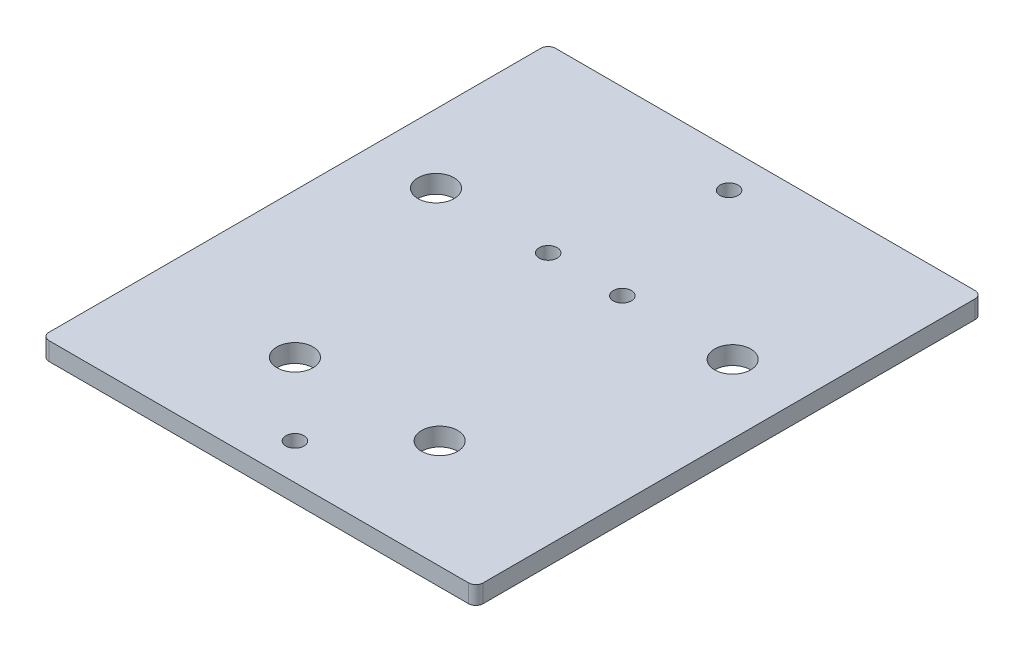
ISO-10303-21;
HEADER;
FILE_DESCRIPTION(('STEP AP214'),'2;1');
FILE_NAME('part.step','',(''),(''),'','','');
FILE_SCHEMA(('AUTOMOTIVE_DESIGN { 1 0 10303 214 1 1 1 1 }'));
ENDSEC;
DATA;
#1=APPLICATION_CONTEXT('core data for automotive mechanical design processes');
#2=APPLICATION_PROTOCOL_DEFINITION('international standard','automotive_design',2000,#1);
#3=PRODUCT_CONTEXT('',#1,'mechanical');
#4=PRODUCT('Part','Part','',(#3));
#5=PRODUCT_RELATED_PRODUCT_CATEGORY('part','',(#4));
#6=PRODUCT_DEFINITION_FORMATION('','',#4);
#7=PRODUCT_DEFINITION_CONTEXT('part definition',#1,'design');
#8=PRODUCT_DEFINITION('design','',#6,#7);
#9=PRODUCT_DEFINITION_SHAPE('','',#8);
#10=(LENGTH_UNIT() NAMED_UNIT(*) SI_UNIT(.MILLI.,.METRE.));
#11=(NAMED_UNIT(*) PLANE_ANGLE_UNIT() SI_UNIT($,.RADIAN.));
#12=(NAMED_UNIT(*) SI_UNIT($,.STERADIAN.) SOLID_ANGLE_UNIT());
#13=UNCERTAINTY_MEASURE_WITH_UNIT(LENGTH_MEASURE(1.E-05),#10,'distance_accuracy_value','');
#14=(GEOMETRIC_REPRESENTATION_CONTEXT(3) GLOBAL_UNCERTAINTY_ASSIGNED_CONTEXT((#13)) GLOBAL_UNIT_ASSIGNED_CONTEXT((#10,
#11,#12)) REPRESENTATION_CONTEXT('',''));
#15=CARTESIAN_POINT('',(0.,0.,0.));
#16=DIRECTION('',(0.,0.,1.));
#17=DIRECTION('',(1.,0.,0.));
#18=AXIS2_PLACEMENT_3D('',#15,#16,#17);
#19=CARTESIAN_POINT('',(0.,6.35,0.));
#20=DIRECTION('',(0.,-1.,0.));
#21=DIRECTION('',(0.,0.,-1.));
#22=AXIS2_PLACEMENT_3D('',#19,#20,#21);
#23=PLANE('',#22);
#24=DIRECTION('',(-1.,0.,0.));
#25=VECTOR('',#24,1.);
#26=CARTESIAN_POINT('',(0.,6.35,-177.8));
#27=LINE('',#26,#25);
#28=CARTESIAN_POINT('',(149.86,6.35,-177.8));
#29=VERTEX_POINT('',#28);
#30=CARTESIAN_POINT('',(2.54,6.35,-177.8));
#31=VERTEX_POINT('',#30);
#32=EDGE_CURVE('E140',#29,#31,#27,.T.);
#33=ORIENTED_EDGE('',*,*,#32,.T.);
#34=CARTESIAN_POINT('',(2.54,6.35,-175.26));
#35=DIRECTION('',(0.,-1.,0.));
#36=DIRECTION('',(0.,0.,-1.));
#37=AXIS2_PLACEMENT_3D('',#34,#35,#36);
#38=CIRCLE('',#37,2.54);
#39=CARTESIAN_POINT('',(0.,6.35,-175.26));
#40=VERTEX_POINT('',#39);
#41=EDGE_CURVE('E159',#31,#40,#38,.F.);
#42=ORIENTED_EDGE('',*,*,#41,.T.);
#43=DIRECTION('',(0.,0.,1.));
#44=VECTOR('',#43,1.);
#45=CARTESIAN_POINT('',(0.,6.35,0.));
#46=LINE('',#45,#44);
#47=CARTESIAN_POINT('',(0.,6.35,-2.54));
#48=VERTEX_POINT('',#47);
#49=EDGE_CURVE('E123',#40,#48,#46,.T.);
#50=ORIENTED_EDGE('',*,*,#49,.T.);
#51=CARTESIAN_POINT('',(2.54,6.35,-2.54));
#52=DIRECTION('',(0.,-1.,0.));
#53=DIRECTION('',(0.,0.,-1.));
#54=AXIS2_PLACEMENT_3D('',#51,#52,#53);
#55=CIRCLE('',#54,2.54);
#56=CARTESIAN_POINT('',(2.54,6.35,0.));
#57=VERTEX_POINT('',#56);
#58=EDGE_CURVE('E154',#48,#57,#55,.F.);
#59=ORIENTED_EDGE('',*,*,#58,.T.);
#60=DIRECTION('',(1.,0.,0.));
#61=VECTOR('',#60,1.);
#62=CARTESIAN_POINT('',(0.,6.35,0.));
#63=LINE('',#62,#61);
#64=CARTESIAN_POINT('',(149.86,6.35,0.));
#65=VERTEX_POINT('',#64);
#66=EDGE_CURVE('E170',#57,#65,#63,.T.);
#67=ORIENTED_EDGE('',*,*,#66,.T.);
#68=CARTESIAN_POINT('',(149.86,6.35,-2.54000000000002));
#69=DIRECTION('',(0.,-1.,0.));
#70=DIRECTION('',(0.,0.,-1.));
#71=AXIS2_PLACEMENT_3D('',#68,#69,#70);
#72=CIRCLE('',#71,2.54);
#73=CARTESIAN_POINT('',(152.4,6.35,-2.54000000000002));
#74=VERTEX_POINT('',#73);
#75=EDGE_CURVE('E59',#65,#74,#72,.F.);
#76=ORIENTED_EDGE('',*,*,#75,.T.);
#77=DIRECTION('',(0.,0.,-1.));
#78=VECTOR('',#77,1.);
#79=CARTESIAN_POINT('',(152.4,6.35,0.));
#80=LINE('',#79,#78);
#81=CARTESIAN_POINT('',(152.4,6.35,-175.26));
#82=VERTEX_POINT('',#81);
#83=EDGE_CURVE('E178',#74,#82,#80,.T.);
#84=ORIENTED_EDGE('',*,*,#83,.T.);
#85=CARTESIAN_POINT('',(149.86,6.35,-175.26));
#86=DIRECTION('',(0.,-1.,0.));
#87=DIRECTION('',(0.,0.,-1.));
#88=AXIS2_PLACEMENT_3D('',#85,#86,#87);
#89=CIRCLE('',#88,2.54);
#90=EDGE_CURVE('E157',#82,#29,#89,.F.);
#91=ORIENTED_EDGE('',*,*,#90,.T.);
#92=EDGE_LOOP('',(#33,#42,#50,#59,#67,#76,#84,#91));
#93=FACE_BOUND('',#92,.T.);
#94=CARTESIAN_POINT('',(24.13,6.35,-114.3));
#95=DIRECTION('',(0.,1.,0.));
#96=DIRECTION('',(0.,0.,1.));
#97=AXIS2_PLACEMENT_3D('',#94,#95,#96);
#98=CIRCLE('',#97,6.35000000000002);
#99=CARTESIAN_POINT('',(24.13,6.35,-107.95));
#100=VERTEX_POINT('',#99);
#101=EDGE_CURVE('E131',#100,#100,#98,.T.);
#102=ORIENTED_EDGE('',*,*,#101,.F.);
#103=EDGE_LOOP('',(#102));
#104=FACE_BOUND('',#103,.T.);
#105=CARTESIAN_POINT('',(128.27,6.35,-114.3));
#106=DIRECTION('',(0.,1.,0.));
#107=DIRECTION('',(0.,0.,1.));
#108=AXIS2_PLACEMENT_3D('',#105,#106,#107);
#109=CIRCLE('',#108,6.34999999999999);
#110=CARTESIAN_POINT('',(128.27,6.35,-107.95));
#111=VERTEX_POINT('',#110);
#112=EDGE_CURVE('E185',#111,#111,#109,.T.);
#113=ORIENTED_EDGE('',*,*,#112,.F.);
#114=EDGE_LOOP('',(#113));
#115=FACE_BOUND('',#114,.T.);
#116=CARTESIAN_POINT('',(50.8,6.35,-38.1));
#117=DIRECTION('',(0.,1.,0.));
#118=DIRECTION('',(0.,0.,1.));
#119=AXIS2_PLACEMENT_3D('',#116,#117,#118);
#120=CIRCLE('',#119,6.35000000000001);
#121=CARTESIAN_POINT('',(50.8,6.35,-31.75));
#122=VERTEX_POINT('',#121);
#123=EDGE_CURVE('E190',#122,#122,#120,.T.);
#124=ORIENTED_EDGE('',*,*,#123,.F.);
#125=EDGE_LOOP('',(#124));
#126=FACE_BOUND('',#125,.T.);
#127=CARTESIAN_POINT('',(101.6,6.35,-38.1));
#128=DIRECTION('',(0.,1.,0.));
#129=DIRECTION('',(0.,0.,1.));
#130=AXIS2_PLACEMENT_3D('',#127,#128,#129);
#131=CIRCLE('',#130,6.35);
#132=CARTESIAN_POINT('',(101.6,6.35,-31.75));
#133=VERTEX_POINT('',#132);
#134=EDGE_CURVE('E196',#133,#133,#131,.T.);
#135=ORIENTED_EDGE('',*,*,#134,.F.);
#136=EDGE_LOOP('',(#135));
#137=FACE_BOUND('',#136,.T.);
#138=CARTESIAN_POINT('',(76.2,6.35,-165.1));
#139=DIRECTION('',(0.,1.,0.));
#140=DIRECTION('',(0.,0.,1.));
#141=AXIS2_PLACEMENT_3D('',#138,#139,#140);
#142=CIRCLE('',#141,3.175);
#143=CARTESIAN_POINT('',(76.2,6.35,-161.925));
#144=VERTEX_POINT('',#143);
#145=EDGE_CURVE('E202',#144,#144,#142,.T.);
#146=ORIENTED_EDGE('',*,*,#145,.F.);
#147=EDGE_LOOP('',(#146));
#148=FACE_BOUND('',#147,.T.);
#149=CARTESIAN_POINT('',(76.2,6.35,-12.7));
#150=DIRECTION('',(0.,1.,0.));
#151=DIRECTION('',(0.,0.,1.));
#152=AXIS2_PLACEMENT_3D('',#149,#150,#151);
#153=CIRCLE('',#152,3.175);
#154=CARTESIAN_POINT('',(76.2,6.35,-9.525));
#155=VERTEX_POINT('',#154);
#156=EDGE_CURVE('E208',#155,#155,#153,.T.);
#157=ORIENTED_EDGE('',*,*,#156,.F.);
#158=EDGE_LOOP('',(#157));
#159=FACE_BOUND('',#158,.T.);
#160=CARTESIAN_POINT('',(63.5,6.35,-114.3));
#161=DIRECTION('',(0.,1.,0.));
#162=DIRECTION('',(0.,0.,1.));
#163=AXIS2_PLACEMENT_3D('',#160,#161,#162);
#164=CIRCLE('',#163,3.175);
#165=CARTESIAN_POINT('',(63.5,6.35,-111.125));
#166=VERTEX_POINT('',#165);
#167=EDGE_CURVE('E214',#166,#166,#164,.T.);
#168=ORIENTED_EDGE('',*,*,#167,.F.);
#169=EDGE_LOOP('',(#168));
#170=FACE_BOUND('',#169,.T.);
#171=CARTESIAN_POINT('',(89.535,6.35,-114.3));
#172=DIRECTION('',(0.,1.,0.));
#173=DIRECTION('',(0.,0.,1.));
#174=AXIS2_PLACEMENT_3D('',#171,#172,#173);
#175=CIRCLE('',#174,3.175);
#176=CARTESIAN_POINT('',(89.535,6.35,-111.125));
#177=VERTEX_POINT('',#176);
#178=EDGE_CURVE('E220',#177,#177,#175,.T.);
#179=ORIENTED_EDGE('',*,*,#178,.F.);
#180=EDGE_LOOP('',(#179));
#181=FACE_BOUND('',#180,.T.);
#182=ADVANCED_FACE('F37',(#93,#104,#115,#126,#137,#148,#159,#170,#181),#23,.F.);
#183=CARTESIAN_POINT('',(0.,0.,0.));
#184=DIRECTION('',(0.,-1.,0.));
#185=DIRECTION('',(0.,0.,-1.));
#186=AXIS2_PLACEMENT_3D('',#183,#184,#185);
#187=PLANE('',#186);
#188=CARTESIAN_POINT('',(63.5,0.,-114.3));
#189=DIRECTION('',(0.,1.,0.));
#190=DIRECTION('',(0.,0.,1.));
#191=AXIS2_PLACEMENT_3D('',#188,#189,#190);
#192=CIRCLE('',#191,3.175);
#193=CARTESIAN_POINT('',(63.5,0.,-111.125));
#194=VERTEX_POINT('',#193);
#195=EDGE_CURVE('E217',#194,#194,#192,.T.);
#196=ORIENTED_EDGE('',*,*,#195,.T.);
#197=EDGE_LOOP('',(#196));
#198=FACE_BOUND('',#197,.T.);
#199=CARTESIAN_POINT('',(76.2,0.,-165.1));
#200=DIRECTION('',(0.,1.,0.));
#201=DIRECTION('',(0.,0.,1.));
#202=AXIS2_PLACEMENT_3D('',#199,#200,#201);
#203=CIRCLE('',#202,3.175);
#204=CARTESIAN_POINT('',(76.2,0.,-161.925));
#205=VERTEX_POINT('',#204);
#206=EDGE_CURVE('E205',#205,#205,#203,.T.);
#207=ORIENTED_EDGE('',*,*,#206,.T.);
#208=EDGE_LOOP('',(#207));
#209=FACE_BOUND('',#208,.T.);
#210=CARTESIAN_POINT('',(50.8,0.,-38.1));
#211=DIRECTION('',(0.,1.,0.));
#212=DIRECTION('',(0.,0.,1.));
#213=AXIS2_PLACEMENT_3D('',#210,#211,#212);
#214=CIRCLE('',#213,6.35000000000001);
#215=CARTESIAN_POINT('',(50.8,0.,-31.75));
#216=VERTEX_POINT('',#215);
#217=EDGE_CURVE('E193',#216,#216,#214,.T.);
#218=ORIENTED_EDGE('',*,*,#217,.T.);
#219=EDGE_LOOP('',(#218));
#220=FACE_BOUND('',#219,.T.);
#221=CARTESIAN_POINT('',(24.13,0.,-114.3));
#222=DIRECTION('',(0.,1.,0.));
#223=DIRECTION('',(0.,0.,1.));
#224=AXIS2_PLACEMENT_3D('',#221,#222,#223);
#225=CIRCLE('',#224,6.35000000000002);
#226=CARTESIAN_POINT('',(24.13,0.,-107.95));
#227=VERTEX_POINT('',#226);
#228=EDGE_CURVE('E137',#227,#227,#225,.T.);
#229=ORIENTED_EDGE('',*,*,#228,.T.);
#230=EDGE_LOOP('',(#229));
#231=FACE_BOUND('',#230,.T.);
#232=DIRECTION('',(0.,0.,1.));
#233=VECTOR('',#232,1.);
#234=CARTESIAN_POINT('',(0.,0.,0.));
#235=LINE('',#234,#233);
#236=CARTESIAN_POINT('',(0.,0.,-175.26));
#237=VERTEX_POINT('',#236);
#238=CARTESIAN_POINT('',(0.,0.,-2.54));
#239=VERTEX_POINT('',#238);
#240=EDGE_CURVE('E120',#237,#239,#235,.T.);
#241=ORIENTED_EDGE('',*,*,#240,.F.);
#242=CARTESIAN_POINT('',(2.54,0.,-175.26));
#243=DIRECTION('',(0.,-1.,0.));
#244=DIRECTION('',(0.,0.,-1.));
#245=AXIS2_PLACEMENT_3D('',#242,#243,#244);
#246=CIRCLE('',#245,2.54);
#247=CARTESIAN_POINT('',(2.54,0.,-177.8));
#248=VERTEX_POINT('',#247);
#249=EDGE_CURVE('E103',#237,#248,#246,.T.);
#250=ORIENTED_EDGE('',*,*,#249,.T.);
#251=DIRECTION('',(-1.,0.,0.));
#252=VECTOR('',#251,1.);
#253=CARTESIAN_POINT('',(0.,0.,-177.8));
#254=LINE('',#253,#252);
#255=CARTESIAN_POINT('',(149.86,0.,-177.8));
#256=VERTEX_POINT('',#255);
#257=EDGE_CURVE('E144',#256,#248,#254,.T.);
#258=ORIENTED_EDGE('',*,*,#257,.F.);
#259=CARTESIAN_POINT('',(149.86,0.,-175.26));
#260=DIRECTION('',(0.,-1.,0.));
#261=DIRECTION('',(0.,0.,-1.));
#262=AXIS2_PLACEMENT_3D('',#259,#260,#261);
#263=CIRCLE('',#262,2.54);
#264=CARTESIAN_POINT('',(152.4,0.,-175.26));
#265=VERTEX_POINT('',#264);
#266=EDGE_CURVE('E114',#256,#265,#263,.T.);
#267=ORIENTED_EDGE('',*,*,#266,.T.);
#268=DIRECTION('',(0.,0.,-1.));
#269=VECTOR('',#268,1.);
#270=CARTESIAN_POINT('',(152.4,0.,0.));
#271=LINE('',#270,#269);
#272=CARTESIAN_POINT('',(152.4,0.,-2.54000000000002));
#273=VERTEX_POINT('',#272);
#274=EDGE_CURVE('E134',#273,#265,#271,.T.);
#275=ORIENTED_EDGE('',*,*,#274,.F.);
#276=CARTESIAN_POINT('',(149.86,0.,-2.54000000000002));
#277=DIRECTION('',(0.,-1.,0.));
#278=DIRECTION('',(0.,0.,-1.));
#279=AXIS2_PLACEMENT_3D('',#276,#277,#278);
#280=CIRCLE('',#279,2.54);
#281=CARTESIAN_POINT('',(149.86,0.,0.));
#282=VERTEX_POINT('',#281);
#283=EDGE_CURVE('E148',#273,#282,#280,.T.);
#284=ORIENTED_EDGE('',*,*,#283,.T.);
#285=DIRECTION('',(1.,0.,0.));
#286=VECTOR('',#285,1.);
#287=CARTESIAN_POINT('',(0.,0.,0.));
#288=LINE('',#287,#286);
#289=CARTESIAN_POINT('',(2.54,0.,0.));
#290=VERTEX_POINT('',#289);
#291=EDGE_CURVE('E130',#290,#282,#288,.T.);
#292=ORIENTED_EDGE('',*,*,#291,.F.);
#293=CARTESIAN_POINT('',(2.54,0.,-2.54));
#294=DIRECTION('',(0.,-1.,0.));
#295=DIRECTION('',(0.,0.,-1.));
#296=AXIS2_PLACEMENT_3D('',#293,#294,#295);
#297=CIRCLE('',#296,2.54);
#298=EDGE_CURVE('E124',#290,#239,#297,.T.);
#299=ORIENTED_EDGE('',*,*,#298,.T.);
#300=EDGE_LOOP('',(#241,#250,#258,#267,#275,#284,#292,#299));
#301=FACE_BOUND('',#300,.T.);
#302=CARTESIAN_POINT('',(128.27,0.,-114.3));
#303=DIRECTION('',(0.,1.,0.));
#304=DIRECTION('',(0.,0.,1.));
#305=AXIS2_PLACEMENT_3D('',#302,#303,#304);
#306=CIRCLE('',#305,6.34999999999999);
#307=CARTESIAN_POINT('',(128.27,0.,-107.95));
#308=VERTEX_POINT('',#307);
#309=EDGE_CURVE('E187',#308,#308,#306,.T.);
#310=ORIENTED_EDGE('',*,*,#309,.T.);
#311=EDGE_LOOP('',(#310));
#312=FACE_BOUND('',#311,.T.);
#313=CARTESIAN_POINT('',(101.6,0.,-38.1));
#314=DIRECTION('',(0.,1.,0.));
#315=DIRECTION('',(0.,0.,1.));
#316=AXIS2_PLACEMENT_3D('',#313,#314,#315);
#317=CIRCLE('',#316,6.35);
#318=CARTESIAN_POINT('',(101.6,0.,-31.75));
#319=VERTEX_POINT('',#318);
#320=EDGE_CURVE('E199',#319,#319,#317,.T.);
#321=ORIENTED_EDGE('',*,*,#320,.T.);
#322=EDGE_LOOP('',(#321));
#323=FACE_BOUND('',#322,.T.);
#324=CARTESIAN_POINT('',(76.2,0.,-12.7));
#325=DIRECTION('',(0.,1.,0.));
#326=DIRECTION('',(0.,0.,1.));
#327=AXIS2_PLACEMENT_3D('',#324,#325,#326);
#328=CIRCLE('',#327,3.175);
#329=CARTESIAN_POINT('',(76.2,0.,-9.525));
#330=VERTEX_POINT('',#329);
#331=EDGE_CURVE('E211',#330,#330,#328,.T.);
#332=ORIENTED_EDGE('',*,*,#331,.T.);
#333=EDGE_LOOP('',(#332));
#334=FACE_BOUND('',#333,.T.);
#335=CARTESIAN_POINT('',(89.535,0.,-114.3));
#336=DIRECTION('',(0.,1.,0.));
#337=DIRECTION('',(0.,0.,1.));
#338=AXIS2_PLACEMENT_3D('',#335,#336,#337);
#339=CIRCLE('',#338,3.175);
#340=CARTESIAN_POINT('',(89.535,0.,-111.125));
#341=VERTEX_POINT('',#340);
#342=EDGE_CURVE('E223',#341,#341,#339,.T.);
#343=ORIENTED_EDGE('',*,*,#342,.T.);
#344=EDGE_LOOP('',(#343));
#345=FACE_BOUND('',#344,.T.);
#346=ADVANCED_FACE('F127',(#198,#209,#220,#231,#301,#312,#323,#334,#345),#187,.T.);
#347=CARTESIAN_POINT('',(0.,6.35,0.));
#348=DIRECTION('',(1.,0.,0.));
#349=DIRECTION('',(0.,0.,-1.));
#350=AXIS2_PLACEMENT_3D('',#347,#348,#349);
#351=PLANE('',#350);
#352=ORIENTED_EDGE('',*,*,#49,.F.);
#353=DIRECTION('',(0.,-1.,0.));
#354=VECTOR('',#353,1.);
#355=CARTESIAN_POINT('',(0.,6.35,-175.26));
#356=LINE('',#355,#354);
#357=EDGE_CURVE('E107',#40,#237,#356,.T.);
#358=ORIENTED_EDGE('',*,*,#357,.T.);
#359=ORIENTED_EDGE('',*,*,#240,.T.);
#360=DIRECTION('',(0.,-1.,0.));
#361=VECTOR('',#360,1.);
#362=CARTESIAN_POINT('',(0.,6.35,-2.54));
#363=LINE('',#362,#361);
#364=EDGE_CURVE('E125',#239,#48,#363,.F.);
#365=ORIENTED_EDGE('',*,*,#364,.T.);
#366=EDGE_LOOP('',(#352,#358,#359,#365));
#367=FACE_BOUND('',#366,.T.);
#368=ADVANCED_FACE('F119',(#367),#351,.F.);
#369=CARTESIAN_POINT('',(0.,6.35,0.));
#370=DIRECTION('',(0.,0.,-1.));
#371=DIRECTION('',(-1.,0.,0.));
#372=AXIS2_PLACEMENT_3D('',#369,#370,#371);
#373=PLANE('',#372);
#374=ORIENTED_EDGE('',*,*,#291,.T.);
#375=DIRECTION('',(0.,-1.,0.));
#376=VECTOR('',#375,1.);
#377=CARTESIAN_POINT('',(149.86,6.35,0.));
#378=LINE('',#377,#376);
#379=EDGE_CURVE('E11',#282,#65,#378,.F.);
#380=ORIENTED_EDGE('',*,*,#379,.T.);
#381=ORIENTED_EDGE('',*,*,#66,.F.);
#382=DIRECTION('',(0.,-1.,0.));
#383=VECTOR('',#382,1.);
#384=CARTESIAN_POINT('',(2.54,6.35,0.));
#385=LINE('',#384,#383);
#386=EDGE_CURVE('E45',#57,#290,#385,.T.);
#387=ORIENTED_EDGE('',*,*,#386,.T.);
#388=EDGE_LOOP('',(#374,#380,#381,#387));
#389=FACE_BOUND('',#388,.T.);
#390=ADVANCED_FACE('F168',(#389),#373,.F.);
#391=CARTESIAN_POINT('',(152.4,6.35,0.));
#392=DIRECTION('',(-1.,0.,0.));
#393=DIRECTION('',(0.,0.,1.));
#394=AXIS2_PLACEMENT_3D('',#391,#392,#393);
#395=PLANE('',#394);
#396=ORIENTED_EDGE('',*,*,#274,.T.);
#397=DIRECTION('',(0.,-1.,0.));
#398=VECTOR('',#397,1.);
#399=CARTESIAN_POINT('',(152.4,6.35,-175.26));
#400=LINE('',#399,#398);
#401=EDGE_CURVE('E52',#265,#82,#400,.F.);
#402=ORIENTED_EDGE('',*,*,#401,.T.);
#403=ORIENTED_EDGE('',*,*,#83,.F.);
#404=DIRECTION('',(0.,-1.,0.));
#405=VECTOR('',#404,1.);
#406=CARTESIAN_POINT('',(152.4,6.35,-2.54000000000002));
#407=LINE('',#406,#405);
#408=EDGE_CURVE('E161',#74,#273,#407,.T.);
#409=ORIENTED_EDGE('',*,*,#408,.T.);
#410=EDGE_LOOP('',(#396,#402,#403,#409));
#411=FACE_BOUND('',#410,.T.);
#412=ADVANCED_FACE('F177',(#411),#395,.F.);
#413=CARTESIAN_POINT('',(0.,6.35,-177.8));
#414=DIRECTION('',(0.,0.,1.));
#415=DIRECTION('',(1.,0.,0.));
#416=AXIS2_PLACEMENT_3D('',#413,#414,#415);
#417=PLANE('',#416);
#418=ORIENTED_EDGE('',*,*,#257,.T.);
#419=DIRECTION('',(0.,-1.,0.));
#420=VECTOR('',#419,1.);
#421=CARTESIAN_POINT('',(2.54,6.35,-177.8));
#422=LINE('',#421,#420);
#423=EDGE_CURVE('E108',#248,#31,#422,.F.);
#424=ORIENTED_EDGE('',*,*,#423,.T.);
#425=ORIENTED_EDGE('',*,*,#32,.F.);
#426=DIRECTION('',(0.,-1.,0.));
#427=VECTOR('',#426,1.);
#428=CARTESIAN_POINT('',(149.86,6.35,-177.8));
#429=LINE('',#428,#427);
#430=EDGE_CURVE('E113',#29,#256,#429,.T.);
#431=ORIENTED_EDGE('',*,*,#430,.T.);
#432=EDGE_LOOP('',(#418,#424,#425,#431));
#433=FACE_BOUND('',#432,.T.);
#434=ADVANCED_FACE('F244',(#433),#417,.F.);
#435=CARTESIAN_POINT('',(24.13,6.35,-114.3));
#436=DIRECTION('',(0.,-1.,0.));
#437=DIRECTION('',(0.,0.,-1.));
#438=AXIS2_PLACEMENT_3D('',#435,#436,#437);
#439=CYLINDRICAL_SURFACE('',#438,6.35000000000002);
#440=ORIENTED_EDGE('',*,*,#101,.T.);
#441=EDGE_LOOP('',(#440));
#442=FACE_BOUND('',#441,.T.);
#443=ORIENTED_EDGE('',*,*,#228,.F.);
#444=EDGE_LOOP('',(#443));
#445=FACE_BOUND('',#444,.T.);
#446=ADVANCED_FACE('F241',(#442,#445),#439,.F.);
#447=CARTESIAN_POINT('',(128.27,6.35,-114.3));
#448=DIRECTION('',(0.,-1.,0.));
#449=DIRECTION('',(0.,0.,-1.));
#450=AXIS2_PLACEMENT_3D('',#447,#448,#449);
#451=CYLINDRICAL_SURFACE('',#450,6.34999999999999);
#452=ORIENTED_EDGE('',*,*,#112,.T.);
#453=EDGE_LOOP('',(#452));
#454=FACE_BOUND('',#453,.T.);
#455=ORIENTED_EDGE('',*,*,#309,.F.);
#456=EDGE_LOOP('',(#455));
#457=FACE_BOUND('',#456,.T.);
#458=ADVANCED_FACE('F377',(#454,#457),#451,.F.);
#459=CARTESIAN_POINT('',(50.8,6.35,-38.1));
#460=DIRECTION('',(0.,-1.,0.));
#461=DIRECTION('',(0.,0.,-1.));
#462=AXIS2_PLACEMENT_3D('',#459,#460,#461);
#463=CYLINDRICAL_SURFACE('',#462,6.35000000000001);
#464=ORIENTED_EDGE('',*,*,#123,.T.);
#465=EDGE_LOOP('',(#464));
#466=FACE_BOUND('',#465,.T.);
#467=ORIENTED_EDGE('',*,*,#217,.F.);
#468=EDGE_LOOP('',(#467));
#469=FACE_BOUND('',#468,.T.);
#470=ADVANCED_FACE('F367',(#466,#469),#463,.F.);
#471=CARTESIAN_POINT('',(101.6,6.35,-38.1));
#472=DIRECTION('',(0.,-1.,0.));
#473=DIRECTION('',(0.,0.,-1.));
#474=AXIS2_PLACEMENT_3D('',#471,#472,#473);
#475=CYLINDRICAL_SURFACE('',#474,6.35);
#476=ORIENTED_EDGE('',*,*,#134,.T.);
#477=EDGE_LOOP('',(#476));
#478=FACE_BOUND('',#477,.T.);
#479=ORIENTED_EDGE('',*,*,#320,.F.);
#480=EDGE_LOOP('',(#479));
#481=FACE_BOUND('',#480,.T.);
#482=ADVANCED_FACE('F357',(#478,#481),#475,.F.);
#483=CARTESIAN_POINT('',(76.2,6.35,-165.1));
#484=DIRECTION('',(0.,-1.,0.));
#485=DIRECTION('',(0.,0.,-1.));
#486=AXIS2_PLACEMENT_3D('',#483,#484,#485);
#487=CYLINDRICAL_SURFACE('',#486,3.175);
#488=ORIENTED_EDGE('',*,*,#145,.T.);
#489=EDGE_LOOP('',(#488));
#490=FACE_BOUND('',#489,.T.);
#491=ORIENTED_EDGE('',*,*,#206,.F.);
#492=EDGE_LOOP('',(#491));
#493=FACE_BOUND('',#492,.T.);
#494=ADVANCED_FACE('F347',(#490,#493),#487,.F.);
#495=CARTESIAN_POINT('',(76.2,6.35,-12.7));
#496=DIRECTION('',(0.,-1.,0.));
#497=DIRECTION('',(0.,0.,-1.));
#498=AXIS2_PLACEMENT_3D('',#495,#496,#497);
#499=CYLINDRICAL_SURFACE('',#498,3.175);
#500=ORIENTED_EDGE('',*,*,#156,.T.);
#501=EDGE_LOOP('',(#500));
#502=FACE_BOUND('',#501,.T.);
#503=ORIENTED_EDGE('',*,*,#331,.F.);
#504=EDGE_LOOP('',(#503));
#505=FACE_BOUND('',#504,.T.);
#506=ADVANCED_FACE('F337',(#502,#505),#499,.F.);
#507=CARTESIAN_POINT('',(63.5,6.35,-114.3));
#508=DIRECTION('',(0.,-1.,0.));
#509=DIRECTION('',(0.,0.,-1.));
#510=AXIS2_PLACEMENT_3D('',#507,#508,#509);
#511=CYLINDRICAL_SURFACE('',#510,3.175);
#512=ORIENTED_EDGE('',*,*,#167,.T.);
#513=EDGE_LOOP('',(#512));
#514=FACE_BOUND('',#513,.T.);
#515=ORIENTED_EDGE('',*,*,#195,.F.);
#516=EDGE_LOOP('',(#515));
#517=FACE_BOUND('',#516,.T.);
#518=ADVANCED_FACE('F328',(#514,#517),#511,.F.);
#519=CARTESIAN_POINT('',(89.535,6.35,-114.3));
#520=DIRECTION('',(0.,-1.,0.));
#521=DIRECTION('',(0.,0.,-1.));
#522=AXIS2_PLACEMENT_3D('',#519,#520,#521);
#523=CYLINDRICAL_SURFACE('',#522,3.175);
#524=ORIENTED_EDGE('',*,*,#178,.T.);
#525=EDGE_LOOP('',(#524));
#526=FACE_BOUND('',#525,.T.);
#527=ORIENTED_EDGE('',*,*,#342,.F.);
#528=EDGE_LOOP('',(#527));
#529=FACE_BOUND('',#528,.T.);
#530=ADVANCED_FACE('F229',(#526,#529),#523,.F.);
#531=CARTESIAN_POINT('',(2.54,6.35,-175.26));
#532=DIRECTION('',(0.,-1.,0.));
#533=DIRECTION('',(0.,0.,-1.));
#534=AXIS2_PLACEMENT_3D('',#531,#532,#533);
#535=CYLINDRICAL_SURFACE('',#534,2.54);
#536=ORIENTED_EDGE('',*,*,#41,.F.);
#537=ORIENTED_EDGE('',*,*,#423,.F.);
#538=ORIENTED_EDGE('',*,*,#249,.F.);
#539=ORIENTED_EDGE('',*,*,#357,.F.);
#540=EDGE_LOOP('',(#536,#537,#538,#539));
#541=FACE_BOUND('',#540,.T.);
#542=ADVANCED_FACE('F106',(#541),#535,.T.);
#543=CARTESIAN_POINT('',(149.86,6.35,-175.26));
#544=DIRECTION('',(0.,-1.,0.));
#545=DIRECTION('',(0.,0.,-1.));
#546=AXIS2_PLACEMENT_3D('',#543,#544,#545);
#547=CYLINDRICAL_SURFACE('',#546,2.54);
#548=ORIENTED_EDGE('',*,*,#90,.F.);
#549=ORIENTED_EDGE('',*,*,#401,.F.);
#550=ORIENTED_EDGE('',*,*,#266,.F.);
#551=ORIENTED_EDGE('',*,*,#430,.F.);
#552=EDGE_LOOP('',(#548,#549,#550,#551));
#553=FACE_BOUND('',#552,.T.);
#554=ADVANCED_FACE('F256',(#553),#547,.T.);
#555=CARTESIAN_POINT('',(149.86,6.35,-2.54000000000002));
#556=DIRECTION('',(0.,-1.,0.));
#557=DIRECTION('',(0.,0.,-1.));
#558=AXIS2_PLACEMENT_3D('',#555,#556,#557);
#559=CYLINDRICAL_SURFACE('',#558,2.54);
#560=ORIENTED_EDGE('',*,*,#75,.F.);
#561=ORIENTED_EDGE('',*,*,#379,.F.);
#562=ORIENTED_EDGE('',*,*,#283,.F.);
#563=ORIENTED_EDGE('',*,*,#408,.F.);
#564=EDGE_LOOP('',(#560,#561,#562,#563));
#565=FACE_BOUND('',#564,.T.);
#566=ADVANCED_FACE('F176',(#565),#559,.T.);
#567=CARTESIAN_POINT('',(2.54,6.35,-2.54));
#568=DIRECTION('',(0.,-1.,0.));
#569=DIRECTION('',(0.,0.,-1.));
#570=AXIS2_PLACEMENT_3D('',#567,#568,#569);
#571=CYLINDRICAL_SURFACE('',#570,2.54);
#572=ORIENTED_EDGE('',*,*,#58,.F.);
#573=ORIENTED_EDGE('',*,*,#364,.F.);
#574=ORIENTED_EDGE('',*,*,#298,.F.);
#575=ORIENTED_EDGE('',*,*,#386,.F.);
#576=EDGE_LOOP('',(#572,#573,#574,#575));
#577=FACE_BOUND('',#576,.T.);
#578=ADVANCED_FACE('F39',(#577),#571,.T.);
#579=CLOSED_SHELL('',(#182,#346,#368,#390,#412,#434,#446,#458,#470,#482,#494,#506,#518,#530,
#542,#554,#566,#578));
#580=MANIFOLD_SOLID_BREP('B2',#579);
#581=ADVANCED_BREP_SHAPE_REPRESENTATION('',(#18,#580),#14);
#582=SHAPE_DEFINITION_REPRESENTATION(#9,#581);
ENDSEC;
END-ISO-10303-21;
